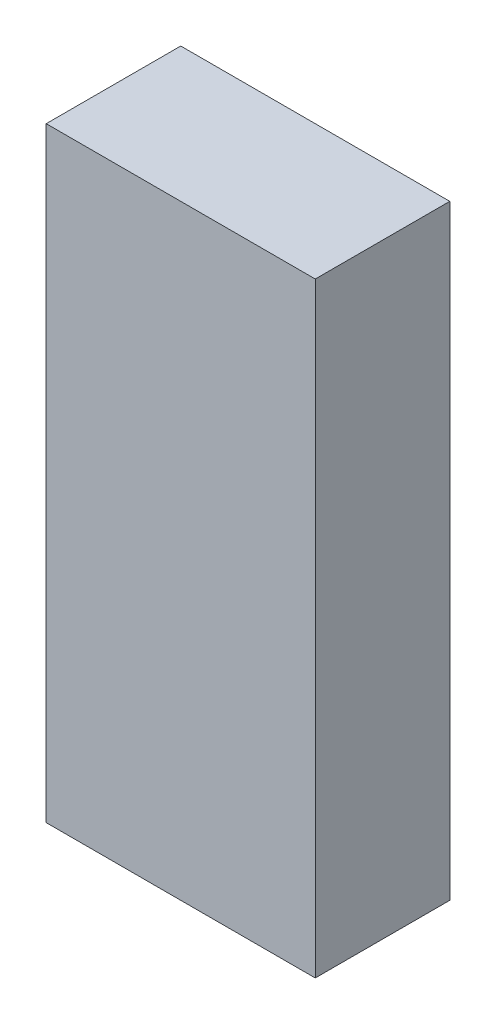
ISO-10303-21;
HEADER;
FILE_DESCRIPTION(('STEP AP214'),'2;1');
FILE_NAME('part.step','',(''),(''),'','','');
FILE_SCHEMA(('AUTOMOTIVE_DESIGN { 1 0 10303 214 1 1 1 1 }'));
ENDSEC;
DATA;
#1=APPLICATION_CONTEXT('core data for automotive mechanical design processes');
#2=APPLICATION_PROTOCOL_DEFINITION('international standard','automotive_design',2000,#1);
#3=PRODUCT_CONTEXT('',#1,'mechanical');
#4=PRODUCT('Part','Part','',(#3));
#5=PRODUCT_RELATED_PRODUCT_CATEGORY('part','',(#4));
#6=PRODUCT_DEFINITION_FORMATION('','',#4);
#7=PRODUCT_DEFINITION_CONTEXT('part definition',#1,'design');
#8=PRODUCT_DEFINITION('design','',#6,#7);
#9=PRODUCT_DEFINITION_SHAPE('','',#8);
#10=(LENGTH_UNIT() NAMED_UNIT(*) SI_UNIT(.MILLI.,.METRE.));
#11=(NAMED_UNIT(*) PLANE_ANGLE_UNIT() SI_UNIT($,.RADIAN.));
#12=(NAMED_UNIT(*) SI_UNIT($,.STERADIAN.) SOLID_ANGLE_UNIT());
#13=UNCERTAINTY_MEASURE_WITH_UNIT(LENGTH_MEASURE(1.E-05),#10,'distance_accuracy_value','');
#14=(GEOMETRIC_REPRESENTATION_CONTEXT(3) GLOBAL_UNCERTAINTY_ASSIGNED_CONTEXT((#13)) GLOBAL_UNIT_ASSIGNED_CONTEXT((#10,
#11,#12)) REPRESENTATION_CONTEXT('',''));
#15=CARTESIAN_POINT('',(0.,0.,0.));
#16=DIRECTION('',(0.,0.,1.));
#17=DIRECTION('',(1.,0.,0.));
#18=AXIS2_PLACEMENT_3D('',#15,#16,#17);
#19=CARTESIAN_POINT('',(-0.6,-2.975,0.));
#20=DIRECTION('',(1.,0.,0.));
#21=DIRECTION('',(0.,0.,1.));
#22=AXIS2_PLACEMENT_3D('',#19,#20,#21);
#23=PLANE('',#22);
#24=DIRECTION('',(0.,1.,0.));
#25=VECTOR('',#24,1.);
#26=CARTESIAN_POINT('',(-0.6,-2.975,0.1));
#27=LINE('',#26,#25);
#28=CARTESIAN_POINT('',(-0.6,-2.975,0.1));
#29=VERTEX_POINT('',#28);
#30=CARTESIAN_POINT('',(-0.6,-2.525,0.1));
#31=VERTEX_POINT('',#30);
#32=EDGE_CURVE('E11',#29,#31,#27,.T.);
#33=ORIENTED_EDGE('',*,*,#32,.T.);
#34=DIRECTION('',(0.,0.,1.));
#35=VECTOR('',#34,1.);
#36=CARTESIAN_POINT('',(-0.6,-2.525,0.));
#37=LINE('',#36,#35);
#38=CARTESIAN_POINT('',(-0.6,-2.525,0.));
#39=VERTEX_POINT('',#38);
#40=EDGE_CURVE('E24',#39,#31,#37,.T.);
#41=ORIENTED_EDGE('',*,*,#40,.F.);
#42=DIRECTION('',(0.,1.,0.));
#43=VECTOR('',#42,1.);
#44=CARTESIAN_POINT('',(-0.6,-2.975,0.));
#45=LINE('',#44,#43);
#46=CARTESIAN_POINT('',(-0.6,-2.975,0.));
#47=VERTEX_POINT('',#46);
#48=EDGE_CURVE('E86',#47,#39,#45,.T.);
#49=ORIENTED_EDGE('',*,*,#48,.F.);
#50=DIRECTION('',(0.,0.,1.));
#51=VECTOR('',#50,1.);
#52=CARTESIAN_POINT('',(-0.6,-2.975,0.));
#53=LINE('',#52,#51);
#54=EDGE_CURVE('E36',#47,#29,#53,.T.);
#55=ORIENTED_EDGE('',*,*,#54,.T.);
#56=EDGE_LOOP('',(#33,#41,#49,#55));
#57=FACE_BOUND('',#56,.T.);
#58=ADVANCED_FACE('F17',(#57),#23,.F.);
#59=CARTESIAN_POINT('',(-0.4,-2.975,0.));
#60=DIRECTION('',(1.,0.,0.));
#61=DIRECTION('',(0.,0.,1.));
#62=AXIS2_PLACEMENT_3D('',#59,#60,#61);
#63=PLANE('',#62);
#64=DIRECTION('',(0.,0.,1.));
#65=VECTOR('',#64,1.);
#66=CARTESIAN_POINT('',(-0.4,-2.975,0.));
#67=LINE('',#66,#65);
#68=CARTESIAN_POINT('',(-0.4,-2.975,0.));
#69=VERTEX_POINT('',#68);
#70=CARTESIAN_POINT('',(-0.4,-2.975,0.1));
#71=VERTEX_POINT('',#70);
#72=EDGE_CURVE('E83',#69,#71,#67,.T.);
#73=ORIENTED_EDGE('',*,*,#72,.F.);
#74=DIRECTION('',(0.,1.,0.));
#75=VECTOR('',#74,1.);
#76=CARTESIAN_POINT('',(-0.4,-2.975,0.));
#77=LINE('',#76,#75);
#78=CARTESIAN_POINT('',(-0.4,-2.525,0.));
#79=VERTEX_POINT('',#78);
#80=EDGE_CURVE('E63',#69,#79,#77,.T.);
#81=ORIENTED_EDGE('',*,*,#80,.T.);
#82=DIRECTION('',(0.,0.,1.));
#83=VECTOR('',#82,1.);
#84=CARTESIAN_POINT('',(-0.4,-2.525,0.));
#85=LINE('',#84,#83);
#86=CARTESIAN_POINT('',(-0.4,-2.525,0.1));
#87=VERTEX_POINT('',#86);
#88=EDGE_CURVE('E57',#79,#87,#85,.T.);
#89=ORIENTED_EDGE('',*,*,#88,.T.);
#90=DIRECTION('',(0.,1.,0.));
#91=VECTOR('',#90,1.);
#92=CARTESIAN_POINT('',(-0.4,-2.975,0.1));
#93=LINE('',#92,#91);
#94=EDGE_CURVE('E60',#71,#87,#93,.T.);
#95=ORIENTED_EDGE('',*,*,#94,.F.);
#96=EDGE_LOOP('',(#73,#81,#89,#95));
#97=FACE_BOUND('',#96,.T.);
#98=ADVANCED_FACE('F59',(#97),#63,.T.);
#99=CARTESIAN_POINT('',(-0.6,-2.975,0.));
#100=DIRECTION('',(0.,1.,0.));
#101=DIRECTION('',(0.,0.,1.));
#102=AXIS2_PLACEMENT_3D('',#99,#100,#101);
#103=PLANE('',#102);
#104=ORIENTED_EDGE('',*,*,#72,.T.);
#105=DIRECTION('',(1.,0.,0.));
#106=VECTOR('',#105,1.);
#107=CARTESIAN_POINT('',(-0.6,-2.975,0.1));
#108=LINE('',#107,#106);
#109=EDGE_CURVE('E71',#29,#71,#108,.T.);
#110=ORIENTED_EDGE('',*,*,#109,.F.);
#111=ORIENTED_EDGE('',*,*,#54,.F.);
#112=DIRECTION('',(1.,0.,0.));
#113=VECTOR('',#112,1.);
#114=CARTESIAN_POINT('',(-0.6,-2.975,0.));
#115=LINE('',#114,#113);
#116=EDGE_CURVE('E76',#47,#69,#115,.T.);
#117=ORIENTED_EDGE('',*,*,#116,.T.);
#118=EDGE_LOOP('',(#104,#110,#111,#117));
#119=FACE_BOUND('',#118,.T.);
#120=ADVANCED_FACE('F91',(#119),#103,.F.);
#121=CARTESIAN_POINT('',(-0.6,-2.525,0.));
#122=DIRECTION('',(0.,1.,0.));
#123=DIRECTION('',(0.,0.,1.));
#124=AXIS2_PLACEMENT_3D('',#121,#122,#123);
#125=PLANE('',#124);
#126=DIRECTION('',(1.,0.,0.));
#127=VECTOR('',#126,1.);
#128=CARTESIAN_POINT('',(-0.6,-2.525,0.));
#129=LINE('',#128,#127);
#130=EDGE_CURVE('E74',#39,#79,#129,.T.);
#131=ORIENTED_EDGE('',*,*,#130,.F.);
#132=ORIENTED_EDGE('',*,*,#40,.T.);
#133=DIRECTION('',(1.,0.,0.));
#134=VECTOR('',#133,1.);
#135=CARTESIAN_POINT('',(-0.6,-2.525,0.1));
#136=LINE('',#135,#134);
#137=EDGE_CURVE('E69',#31,#87,#136,.T.);
#138=ORIENTED_EDGE('',*,*,#137,.T.);
#139=ORIENTED_EDGE('',*,*,#88,.F.);
#140=EDGE_LOOP('',(#131,#132,#138,#139));
#141=FACE_BOUND('',#140,.T.);
#142=ADVANCED_FACE('F73',(#141),#125,.T.);
#143=CARTESIAN_POINT('',(-0.6,-2.975,0.));
#144=DIRECTION('',(0.,0.,1.));
#145=DIRECTION('',(1.,0.,0.));
#146=AXIS2_PLACEMENT_3D('',#143,#144,#145);
#147=PLANE('',#146);
#148=ORIENTED_EDGE('',*,*,#130,.T.);
#149=ORIENTED_EDGE('',*,*,#80,.F.);
#150=ORIENTED_EDGE('',*,*,#116,.F.);
#151=ORIENTED_EDGE('',*,*,#48,.T.);
#152=EDGE_LOOP('',(#148,#149,#150,#151));
#153=FACE_BOUND('',#152,.T.);
#154=ADVANCED_FACE('F89',(#153),#147,.F.);
#155=CARTESIAN_POINT('',(-0.6,-2.975,0.1));
#156=DIRECTION('',(0.,0.,1.));
#157=DIRECTION('',(1.,0.,0.));
#158=AXIS2_PLACEMENT_3D('',#155,#156,#157);
#159=PLANE('',#158);
#160=ORIENTED_EDGE('',*,*,#32,.F.);
#161=ORIENTED_EDGE('',*,*,#109,.T.);
#162=ORIENTED_EDGE('',*,*,#94,.T.);
#163=ORIENTED_EDGE('',*,*,#137,.F.);
#164=EDGE_LOOP('',(#160,#161,#162,#163));
#165=FACE_BOUND('',#164,.T.);
#166=ADVANCED_FACE('F68',(#165),#159,.T.);
#167=CLOSED_SHELL('',(#58,#98,#120,#142,#154,#166));
#168=MANIFOLD_SOLID_BREP('B1',#167);
#169=ADVANCED_BREP_SHAPE_REPRESENTATION('',(#18,#168),#14);
#170=SHAPE_DEFINITION_REPRESENTATION(#9,#169);
ENDSEC;
END-ISO-10303-21;
